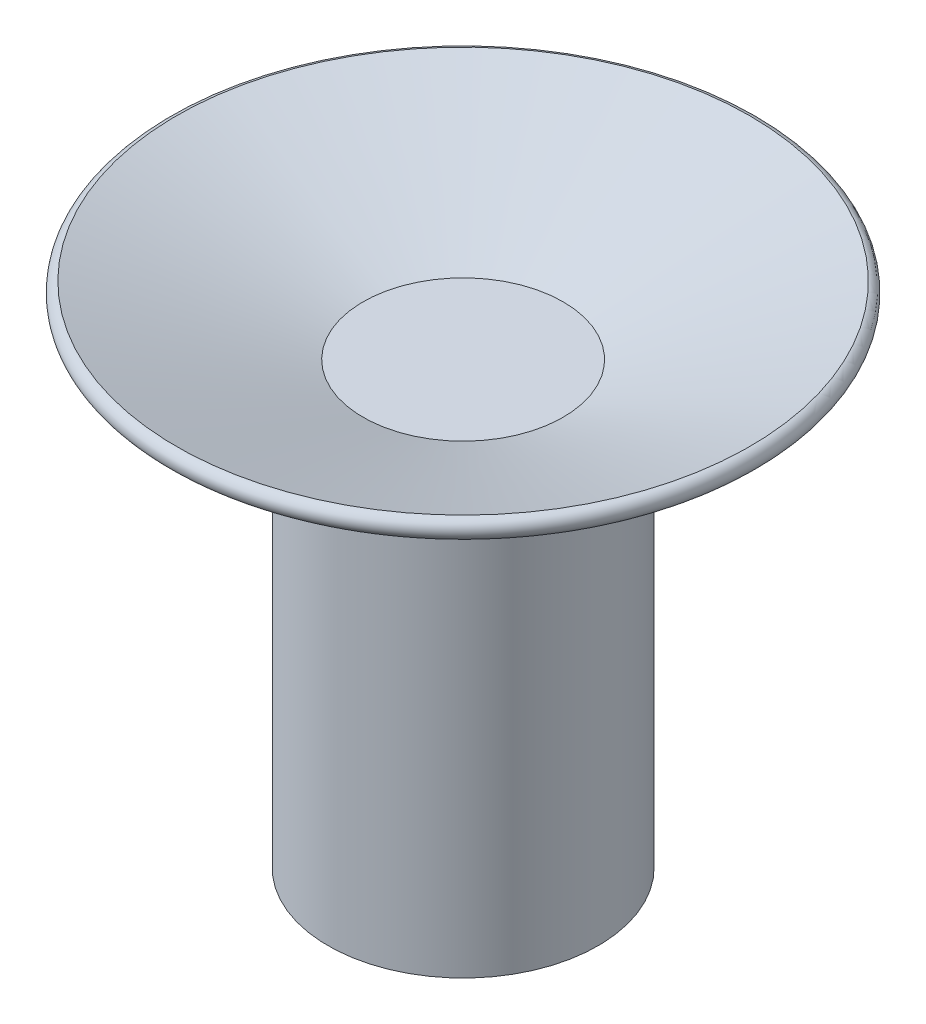
ISO-10303-21;
HEADER;
FILE_DESCRIPTION(('STEP AP214'),'2;1');
FILE_NAME('part.step','',(''),(''),'','','');
FILE_SCHEMA(('AUTOMOTIVE_DESIGN { 1 0 10303 214 1 1 1 1 }'));
ENDSEC;
DATA;
#1=APPLICATION_CONTEXT('core data for automotive mechanical design processes');
#2=APPLICATION_PROTOCOL_DEFINITION('international standard','automotive_design',2000,#1);
#3=PRODUCT_CONTEXT('',#1,'mechanical');
#4=PRODUCT('Part','Part','',(#3));
#5=PRODUCT_RELATED_PRODUCT_CATEGORY('part','',(#4));
#6=PRODUCT_DEFINITION_FORMATION('','',#4);
#7=PRODUCT_DEFINITION_CONTEXT('part definition',#1,'design');
#8=PRODUCT_DEFINITION('design','',#6,#7);
#9=PRODUCT_DEFINITION_SHAPE('','',#8);
#10=(LENGTH_UNIT() NAMED_UNIT(*) SI_UNIT(.MILLI.,.METRE.));
#11=(NAMED_UNIT(*) PLANE_ANGLE_UNIT() SI_UNIT($,.RADIAN.));
#12=(NAMED_UNIT(*) SI_UNIT($,.STERADIAN.) SOLID_ANGLE_UNIT());
#13=UNCERTAINTY_MEASURE_WITH_UNIT(LENGTH_MEASURE(1.E-05),#10,'distance_accuracy_value','');
#14=(GEOMETRIC_REPRESENTATION_CONTEXT(3) GLOBAL_UNCERTAINTY_ASSIGNED_CONTEXT((#13)) GLOBAL_UNIT_ASSIGNED_CONTEXT((#10,
#11,#12)) REPRESENTATION_CONTEXT('',''));
#15=CARTESIAN_POINT('',(0.,0.,0.));
#16=DIRECTION('',(0.,0.,1.));
#17=DIRECTION('',(1.,0.,0.));
#18=AXIS2_PLACEMENT_3D('',#15,#16,#17);
#19=CARTESIAN_POINT('',(0.,0.,0.));
#20=DIRECTION('',(0.,-1.,0.));
#21=DIRECTION('',(0.,0.,-1.));
#22=AXIS2_PLACEMENT_3D('',#19,#20,#21);
#23=PLANE('',#22);
#24=DIRECTION('',(0.997623228537443,0.,0.0689049626843327));
#25=VECTOR('',#24,1.);
#26=CARTESIAN_POINT('',(-2.19569083068635,0.,-4.4920977033052));
#27=LINE('',#26,#25);
#28=CARTESIAN_POINT('',(-2.19569083068635,0.,-4.49209770330521));
#29=VERTEX_POINT('',#28);
#30=CARTESIAN_POINT('',(2.79242531200086,0.,-4.14757288988354));
#31=VERTEX_POINT('',#30);
#32=EDGE_CURVE('E47',#29,#31,#27,.T.);
#33=ORIENTED_EDGE('',*,*,#32,.F.);
#34=CARTESIAN_POINT('',(0.,0.,0.));
#35=DIRECTION('',(0.,-1.,0.));
#36=DIRECTION('',(0.,0.,-1.));
#37=AXIS2_PLACEMENT_3D('',#34,#35,#36);
#38=CIRCLE('',#37,5.);
#39=EDGE_CURVE('E41',#29,#31,#38,.T.);
#40=ORIENTED_EDGE('',*,*,#39,.T.);
#41=EDGE_LOOP('',(#33,#40));
#42=FACE_BOUND('',#41,.T.);
#43=ADVANCED_FACE('F32',(#42),#23,.T.);
#44=DIRECTION('',(0.558485062400172,0.,-0.829514577976708));
#45=VECTOR('',#44,1.);
#46=CARTESIAN_POINT('',(-4.98811614268721,0.,-0.344524813421662));
#47=LINE('',#46,#45);
#48=CARTESIAN_POINT('',(-4.98811614268721,0.,-0.344524813421667));
#49=VERTEX_POINT('',#48);
#50=EDGE_CURVE('E54',#49,#29,#47,.T.);
#51=ORIENTED_EDGE('',*,*,#50,.F.);
#52=EDGE_CURVE('E151',#49,#29,#38,.T.);
#53=ORIENTED_EDGE('',*,*,#52,.T.);
#54=EDGE_LOOP('',(#51,#53));
#55=FACE_BOUND('',#54,.T.);
#56=ADVANCED_FACE('F201',(#55),#23,.T.);
#57=DIRECTION('',(-0.439138166137271,0.,-0.898419540661041));
#58=VECTOR('',#57,1.);
#59=CARTESIAN_POINT('',(-2.79242531200086,0.,4.14757288988354));
#60=LINE('',#59,#58);
#61=CARTESIAN_POINT('',(-2.79242531200086,0.,4.14757288988354));
#62=VERTEX_POINT('',#61);
#63=EDGE_CURVE('E127',#62,#49,#60,.T.);
#64=ORIENTED_EDGE('',*,*,#63,.F.);
#65=EDGE_CURVE('E153',#62,#49,#38,.T.);
#66=ORIENTED_EDGE('',*,*,#65,.T.);
#67=EDGE_LOOP('',(#64,#66));
#68=FACE_BOUND('',#67,.T.);
#69=ADVANCED_FACE('F205',(#68),#23,.T.);
#70=DIRECTION('',(-0.997623228537443,0.,-0.0689049626843323));
#71=VECTOR('',#70,1.);
#72=CARTESIAN_POINT('',(2.19569083068635,0.,4.4920977033052));
#73=LINE('',#72,#71);
#74=CARTESIAN_POINT('',(2.19569083068634,0.,4.49209770330521));
#75=VERTEX_POINT('',#74);
#76=EDGE_CURVE('E124',#75,#62,#73,.T.);
#77=ORIENTED_EDGE('',*,*,#76,.F.);
#78=EDGE_CURVE('E155',#75,#62,#38,.T.);
#79=ORIENTED_EDGE('',*,*,#78,.T.);
#80=EDGE_LOOP('',(#77,#79));
#81=FACE_BOUND('',#80,.T.);
#82=ADVANCED_FACE('F214',(#81),#23,.T.);
#83=DIRECTION('',(-0.558485062400172,0.,0.829514577976708));
#84=VECTOR('',#83,1.);
#85=CARTESIAN_POINT('',(4.98811614268721,0.,0.344524813421662));
#86=LINE('',#85,#84);
#87=CARTESIAN_POINT('',(4.98811614268721,0.,0.344524813421662));
#88=VERTEX_POINT('',#87);
#89=EDGE_CURVE('E121',#88,#75,#86,.T.);
#90=ORIENTED_EDGE('',*,*,#89,.F.);
#91=EDGE_CURVE('E40',#88,#75,#38,.T.);
#92=ORIENTED_EDGE('',*,*,#91,.T.);
#93=EDGE_LOOP('',(#90,#92));
#94=FACE_BOUND('',#93,.T.);
#95=ADVANCED_FACE('F165',(#94),#23,.T.);
#96=DIRECTION('',(0.43913816613727,0.,0.898419540661041));
#97=VECTOR('',#96,1.);
#98=CARTESIAN_POINT('',(2.79242531200086,0.,-4.14757288988354));
#99=LINE('',#98,#97);
#100=EDGE_CURVE('E117',#31,#88,#99,.T.);
#101=ORIENTED_EDGE('',*,*,#100,.F.);
#102=EDGE_CURVE('E11',#31,#88,#38,.T.);
#103=ORIENTED_EDGE('',*,*,#102,.T.);
#104=EDGE_LOOP('',(#101,#103));
#105=FACE_BOUND('',#104,.T.);
#106=ADVANCED_FACE('F34',(#105),#23,.T.);
#107=CARTESIAN_POINT('',(0.,0.,0.));
#108=DIRECTION('',(0.,1.,0.));
#109=DIRECTION('',(0.,0.,1.));
#110=AXIS2_PLACEMENT_3D('',#107,#108,#109);
#111=CONICAL_SURFACE('',#110,5.,1.22173047639603);
#112=CARTESIAN_POINT('',(0.,3.4202014332567,0.));
#113=DIRECTION('',(0.,-1.,0.));
#114=DIRECTION('',(0.,0.,-1.));
#115=AXIS2_PLACEMENT_3D('',#112,#113,#114);
#116=CIRCLE('',#115,14.3969262078591);
#117=CARTESIAN_POINT('',(0.,3.4202014332567,-14.3969262078591));
#118=VERTEX_POINT('',#117);
#119=EDGE_CURVE('E147',#118,#118,#116,.T.);
#120=ORIENTED_EDGE('',*,*,#119,.T.);
#121=EDGE_LOOP('',(#120));
#122=FACE_BOUND('',#121,.T.);
#123=ORIENTED_EDGE('',*,*,#102,.F.);
#124=ORIENTED_EDGE('',*,*,#39,.F.);
#125=ORIENTED_EDGE('',*,*,#52,.F.);
#126=ORIENTED_EDGE('',*,*,#65,.F.);
#127=ORIENTED_EDGE('',*,*,#78,.F.);
#128=ORIENTED_EDGE('',*,*,#91,.F.);
#129=EDGE_LOOP('',(#123,#124,#125,#126,#127,#128));
#130=FACE_BOUND('',#129,.T.);
#131=ADVANCED_FACE('F207',(#122,#130),#111,.T.);
#132=CARTESIAN_POINT('',(0.,3.89627362878787,0.));
#133=DIRECTION('',(0.,-1.,0.));
#134=DIRECTION('',(0.,0.,-1.));
#135=AXIS2_PLACEMENT_3D('',#132,#133,#134);
#136=TOROIDAL_SURFACE('',#135,14.223650099324,0.506625448578077);
#137=CARTESIAN_POINT('',(0.,4.39314449683534,0.));
#138=DIRECTION('',(0.,-1.,0.));
#139=DIRECTION('',(0.,0.,-1.));
#140=AXIS2_PLACEMENT_3D('',#137,#138,#139);
#141=CIRCLE('',#140,14.3225878860017);
#142=CARTESIAN_POINT('',(0.,4.39314449683534,-14.3225878860017));
#143=VERTEX_POINT('',#142);
#144=EDGE_CURVE('E145',#143,#143,#141,.T.);
#145=ORIENTED_EDGE('',*,*,#144,.T.);
#146=EDGE_LOOP('',(#145));
#147=FACE_BOUND('',#146,.T.);
#148=ORIENTED_EDGE('',*,*,#119,.F.);
#149=EDGE_LOOP('',(#148));
#150=FACE_BOUND('',#149,.T.);
#151=ADVANCED_FACE('F213',(#147,#150),#136,.T.);
#152=CARTESIAN_POINT('',(0.,4.39314449683534,0.));
#153=DIRECTION('',(0.,1.,0.));
#154=DIRECTION('',(0.,0.,1.));
#155=AXIS2_PLACEMENT_3D('',#152,#153,#154);
#156=CONICAL_SURFACE('',#155,14.3225878860017,1.22173047639603);
#157=CARTESIAN_POINT('',(0.,1.,0.));
#158=DIRECTION('',(0.,-1.,0.));
#159=DIRECTION('',(0.,0.,-1.));
#160=AXIS2_PLACEMENT_3D('',#157,#158,#159);
#161=CIRCLE('',#160,5.);
#162=CARTESIAN_POINT('',(0.,1.,-5.));
#163=VERTEX_POINT('',#162);
#164=EDGE_CURVE('E142',#163,#163,#161,.T.);
#165=ORIENTED_EDGE('',*,*,#164,.T.);
#166=EDGE_LOOP('',(#165));
#167=FACE_BOUND('',#166,.T.);
#168=ORIENTED_EDGE('',*,*,#144,.F.);
#169=EDGE_LOOP('',(#168));
#170=FACE_BOUND('',#169,.T.);
#171=ADVANCED_FACE('F230',(#167,#170),#156,.F.);
#172=CARTESIAN_POINT('',(5.,1.,0.));
#173=DIRECTION('',(0.,1.,0.));
#174=DIRECTION('',(0.,0.,1.));
#175=AXIS2_PLACEMENT_3D('',#172,#173,#174);
#176=PLANE('',#175);
#177=ORIENTED_EDGE('',*,*,#164,.F.);
#178=EDGE_LOOP('',(#177));
#179=FACE_BOUND('',#178,.T.);
#180=ADVANCED_FACE('F224',(#179),#176,.T.);
#181=CARTESIAN_POINT('',(-2.19569083068635,-1.,-4.4920977033052));
#182=DIRECTION('',(-0.0689049626843327,0.,0.997623228537443));
#183=DIRECTION('',(0.997623228537443,0.,0.0689049626843327));
#184=AXIS2_PLACEMENT_3D('',#181,#182,#183);
#185=PLANE('',#184);
#186=ORIENTED_EDGE('',*,*,#32,.T.);
#187=DIRECTION('',(0.,1.,0.));
#188=VECTOR('',#187,1.);
#189=CARTESIAN_POINT('',(2.79242531200086,-1.,-4.14757288988354));
#190=LINE('',#189,#188);
#191=CARTESIAN_POINT('',(2.79242531200086,-1.,-4.14757288988354));
#192=VERTEX_POINT('',#191);
#193=EDGE_CURVE('E93',#192,#31,#190,.T.);
#194=ORIENTED_EDGE('',*,*,#193,.F.);
#195=DIRECTION('',(0.997623228537443,0.,0.0689049626843327));
#196=VECTOR('',#195,1.);
#197=CARTESIAN_POINT('',(-2.19569083068635,-1.,-4.4920977033052));
#198=LINE('',#197,#196);
#199=CARTESIAN_POINT('',(-2.19569083068635,-1.,-4.4920977033052));
#200=VERTEX_POINT('',#199);
#201=EDGE_CURVE('E88',#200,#192,#198,.T.);
#202=ORIENTED_EDGE('',*,*,#201,.F.);
#203=DIRECTION('',(0.,1.,0.));
#204=VECTOR('',#203,1.);
#205=CARTESIAN_POINT('',(-2.19569083068635,-1.,-4.4920977033052));
#206=LINE('',#205,#204);
#207=EDGE_CURVE('E91',#200,#29,#206,.T.);
#208=ORIENTED_EDGE('',*,*,#207,.T.);
#209=EDGE_LOOP('',(#186,#194,#202,#208));
#210=FACE_BOUND('',#209,.T.);
#211=ADVANCED_FACE('F90',(#210),#185,.F.);
#212=CARTESIAN_POINT('',(2.79242531200086,-1.,-4.14757288988354));
#213=DIRECTION('',(-0.898419540661041,0.,0.43913816613727));
#214=DIRECTION('',(0.43913816613727,0.,0.898419540661041));
#215=AXIS2_PLACEMENT_3D('',#212,#213,#214);
#216=PLANE('',#215);
#217=ORIENTED_EDGE('',*,*,#100,.T.);
#218=DIRECTION('',(0.,1.,0.));
#219=VECTOR('',#218,1.);
#220=CARTESIAN_POINT('',(4.98811614268721,-1.,0.344524813421662));
#221=LINE('',#220,#219);
#222=CARTESIAN_POINT('',(4.98811614268721,-1.,0.344524813421662));
#223=VERTEX_POINT('',#222);
#224=EDGE_CURVE('E138',#223,#88,#221,.T.);
#225=ORIENTED_EDGE('',*,*,#224,.F.);
#226=DIRECTION('',(0.43913816613727,0.,0.898419540661041));
#227=VECTOR('',#226,1.);
#228=CARTESIAN_POINT('',(2.79242531200086,-1.,-4.14757288988354));
#229=LINE('',#228,#227);
#230=EDGE_CURVE('E97',#192,#223,#229,.T.);
#231=ORIENTED_EDGE('',*,*,#230,.F.);
#232=ORIENTED_EDGE('',*,*,#193,.T.);
#233=EDGE_LOOP('',(#217,#225,#231,#232));
#234=FACE_BOUND('',#233,.T.);
#235=ADVANCED_FACE('F216',(#234),#216,.F.);
#236=CARTESIAN_POINT('',(4.98811614268721,-1.,0.344524813421662));
#237=DIRECTION('',(-0.829514577976708,0.,-0.558485062400172));
#238=DIRECTION('',(-0.558485062400172,0.,0.829514577976708));
#239=AXIS2_PLACEMENT_3D('',#236,#237,#238);
#240=PLANE('',#239);
#241=ORIENTED_EDGE('',*,*,#89,.T.);
#242=DIRECTION('',(0.,1.,0.));
#243=VECTOR('',#242,1.);
#244=CARTESIAN_POINT('',(2.19569083068635,-1.,4.4920977033052));
#245=LINE('',#244,#243);
#246=CARTESIAN_POINT('',(2.19569083068635,-1.,4.4920977033052));
#247=VERTEX_POINT('',#246);
#248=EDGE_CURVE('E135',#247,#75,#245,.T.);
#249=ORIENTED_EDGE('',*,*,#248,.F.);
#250=DIRECTION('',(-0.558485062400172,0.,0.829514577976708));
#251=VECTOR('',#250,1.);
#252=CARTESIAN_POINT('',(4.98811614268721,-1.,0.344524813421662));
#253=LINE('',#252,#251);
#254=EDGE_CURVE('E174',#223,#247,#253,.T.);
#255=ORIENTED_EDGE('',*,*,#254,.F.);
#256=ORIENTED_EDGE('',*,*,#224,.T.);
#257=EDGE_LOOP('',(#241,#249,#255,#256));
#258=FACE_BOUND('',#257,.T.);
#259=ADVANCED_FACE('F168',(#258),#240,.F.);
#260=CARTESIAN_POINT('',(2.19569083068635,-1.,4.4920977033052));
#261=DIRECTION('',(0.0689049626843323,0.,-0.997623228537443));
#262=DIRECTION('',(-0.997623228537443,0.,-0.0689049626843323));
#263=AXIS2_PLACEMENT_3D('',#260,#261,#262);
#264=PLANE('',#263);
#265=ORIENTED_EDGE('',*,*,#76,.T.);
#266=DIRECTION('',(0.,1.,0.));
#267=VECTOR('',#266,1.);
#268=CARTESIAN_POINT('',(-2.79242531200086,-1.,4.14757288988354));
#269=LINE('',#268,#267);
#270=CARTESIAN_POINT('',(-2.79242531200086,-1.,4.14757288988354));
#271=VERTEX_POINT('',#270);
#272=EDGE_CURVE('E132',#271,#62,#269,.T.);
#273=ORIENTED_EDGE('',*,*,#272,.F.);
#274=DIRECTION('',(-0.997623228537443,0.,-0.0689049626843323));
#275=VECTOR('',#274,1.);
#276=CARTESIAN_POINT('',(2.19569083068635,-1.,4.4920977033052));
#277=LINE('',#276,#275);
#278=EDGE_CURVE('E112',#247,#271,#277,.T.);
#279=ORIENTED_EDGE('',*,*,#278,.F.);
#280=ORIENTED_EDGE('',*,*,#248,.T.);
#281=EDGE_LOOP('',(#265,#273,#279,#280));
#282=FACE_BOUND('',#281,.T.);
#283=ADVANCED_FACE('F172',(#282),#264,.F.);
#284=CARTESIAN_POINT('',(-2.79242531200086,-1.,4.14757288988354));
#285=DIRECTION('',(0.898419540661041,0.,-0.439138166137271));
#286=DIRECTION('',(-0.439138166137271,0.,-0.898419540661041));
#287=AXIS2_PLACEMENT_3D('',#284,#285,#286);
#288=PLANE('',#287);
#289=ORIENTED_EDGE('',*,*,#63,.T.);
#290=DIRECTION('',(0.,1.,0.));
#291=VECTOR('',#290,1.);
#292=CARTESIAN_POINT('',(-4.98811614268721,-1.,-0.344524813421662));
#293=LINE('',#292,#291);
#294=CARTESIAN_POINT('',(-4.98811614268721,-1.,-0.344524813421662));
#295=VERTEX_POINT('',#294);
#296=EDGE_CURVE('E105',#295,#49,#293,.T.);
#297=ORIENTED_EDGE('',*,*,#296,.F.);
#298=DIRECTION('',(-0.439138166137271,0.,-0.898419540661041));
#299=VECTOR('',#298,1.);
#300=CARTESIAN_POINT('',(-2.79242531200086,-1.,4.14757288988354));
#301=LINE('',#300,#299);
#302=EDGE_CURVE('E110',#271,#295,#301,.T.);
#303=ORIENTED_EDGE('',*,*,#302,.F.);
#304=ORIENTED_EDGE('',*,*,#272,.T.);
#305=EDGE_LOOP('',(#289,#297,#303,#304));
#306=FACE_BOUND('',#305,.T.);
#307=ADVANCED_FACE('F197',(#306),#288,.F.);
#308=CARTESIAN_POINT('',(-4.98811614268721,-1.,-0.344524813421662));
#309=DIRECTION('',(0.829514577976708,0.,0.558485062400172));
#310=DIRECTION('',(0.558485062400172,0.,-0.829514577976708));
#311=AXIS2_PLACEMENT_3D('',#308,#309,#310);
#312=PLANE('',#311);
#313=ORIENTED_EDGE('',*,*,#50,.T.);
#314=ORIENTED_EDGE('',*,*,#207,.F.);
#315=DIRECTION('',(0.558485062400172,0.,-0.829514577976708));
#316=VECTOR('',#315,1.);
#317=CARTESIAN_POINT('',(-4.98811614268721,-1.,-0.344524813421662));
#318=LINE('',#317,#316);
#319=EDGE_CURVE('E103',#295,#200,#318,.T.);
#320=ORIENTED_EDGE('',*,*,#319,.F.);
#321=ORIENTED_EDGE('',*,*,#296,.T.);
#322=EDGE_LOOP('',(#313,#314,#320,#321));
#323=FACE_BOUND('',#322,.T.);
#324=ADVANCED_FACE('F101',(#323),#312,.F.);
#325=CARTESIAN_POINT('',(0.,-1.,0.));
#326=DIRECTION('',(0.,-1.,0.));
#327=DIRECTION('',(0.,0.,-1.));
#328=AXIS2_PLACEMENT_3D('',#325,#326,#327);
#329=PLANE('',#328);
#330=CARTESIAN_POINT('',(0.,-1.,0.));
#331=DIRECTION('',(0.,-1.,0.));
#332=DIRECTION('',(0.,0.,-1.));
#333=AXIS2_PLACEMENT_3D('',#330,#331,#332);
#334=CIRCLE('',#333,6.75);
#335=CARTESIAN_POINT('',(0.,-1.,-6.75));
#336=VERTEX_POINT('',#335);
#337=EDGE_CURVE('E178',#336,#336,#334,.T.);
#338=ORIENTED_EDGE('',*,*,#337,.F.);
#339=EDGE_LOOP('',(#338));
#340=FACE_BOUND('',#339,.T.);
#341=ORIENTED_EDGE('',*,*,#319,.T.);
#342=ORIENTED_EDGE('',*,*,#201,.T.);
#343=ORIENTED_EDGE('',*,*,#230,.T.);
#344=ORIENTED_EDGE('',*,*,#254,.T.);
#345=ORIENTED_EDGE('',*,*,#278,.T.);
#346=ORIENTED_EDGE('',*,*,#302,.T.);
#347=EDGE_LOOP('',(#341,#342,#343,#344,#345,#346));
#348=FACE_BOUND('',#347,.T.);
#349=ADVANCED_FACE('F107',(#340,#348),#329,.F.);
#350=CARTESIAN_POINT('',(0.,-21.,0.));
#351=DIRECTION('',(0.,1.,0.));
#352=DIRECTION('',(0.,0.,1.));
#353=AXIS2_PLACEMENT_3D('',#350,#351,#352);
#354=CYLINDRICAL_SURFACE('',#353,6.75);
#355=CARTESIAN_POINT('',(0.,-21.,0.));
#356=DIRECTION('',(0.,-1.,0.));
#357=DIRECTION('',(0.,0.,-1.));
#358=AXIS2_PLACEMENT_3D('',#355,#356,#357);
#359=CIRCLE('',#358,6.75);
#360=CARTESIAN_POINT('',(0.,-21.,-6.75));
#361=VERTEX_POINT('',#360);
#362=EDGE_CURVE('E118',#361,#361,#359,.T.);
#363=ORIENTED_EDGE('',*,*,#362,.F.);
#364=EDGE_LOOP('',(#363));
#365=FACE_BOUND('',#364,.T.);
#366=ORIENTED_EDGE('',*,*,#337,.T.);
#367=EDGE_LOOP('',(#366));
#368=FACE_BOUND('',#367,.T.);
#369=ADVANCED_FACE('F186',(#365,#368),#354,.T.);
#370=CARTESIAN_POINT('',(0.,-21.,0.));
#371=DIRECTION('',(0.,-1.,0.));
#372=DIRECTION('',(0.,0.,-1.));
#373=AXIS2_PLACEMENT_3D('',#370,#371,#372);
#374=PLANE('',#373);
#375=ORIENTED_EDGE('',*,*,#362,.T.);
#376=EDGE_LOOP('',(#375));
#377=FACE_BOUND('',#376,.T.);
#378=ADVANCED_FACE('F184',(#377),#374,.T.);
#379=CLOSED_SHELL('',(#43,#56,#69,#82,#95,#106,#131,#151,#171,#180,#211,#235,#259,#283,#307,
#324,#349,#369,#378));
#380=MANIFOLD_SOLID_BREP('B2',#379);
#381=ADVANCED_BREP_SHAPE_REPRESENTATION('',(#18,#380),#14);
#382=SHAPE_DEFINITION_REPRESENTATION(#9,#381);
ENDSEC;
END-ISO-10303-21;
